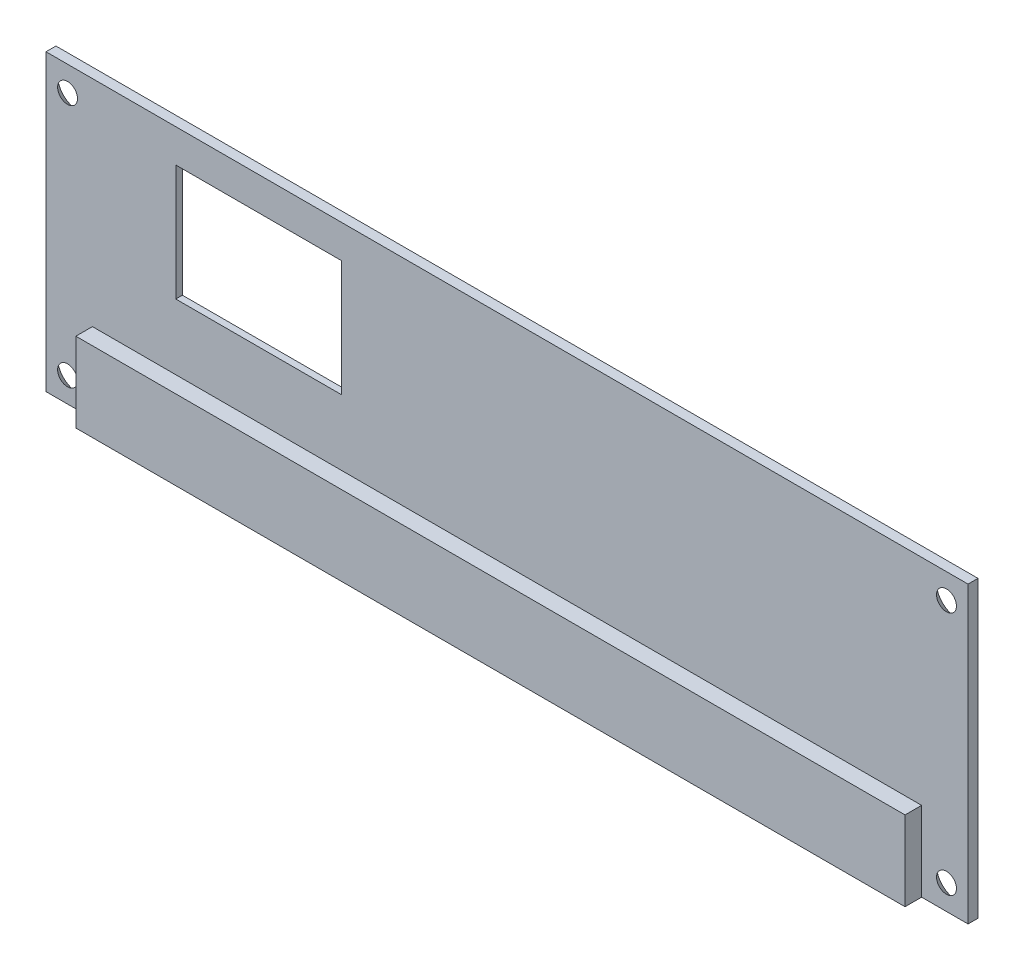
ISO-10303-21;
HEADER;
FILE_DESCRIPTION(('STEP AP214'),'2;1');
FILE_NAME('part.step','',(''),(''),'','','');
FILE_SCHEMA(('AUTOMOTIVE_DESIGN { 1 0 10303 214 1 1 1 1 }'));
ENDSEC;
DATA;
#1=APPLICATION_CONTEXT('core data for automotive mechanical design processes');
#2=APPLICATION_PROTOCOL_DEFINITION('international standard','automotive_design',2000,#1);
#3=PRODUCT_CONTEXT('',#1,'mechanical');
#4=PRODUCT('Part','Part','',(#3));
#5=PRODUCT_RELATED_PRODUCT_CATEGORY('part','',(#4));
#6=PRODUCT_DEFINITION_FORMATION('','',#4);
#7=PRODUCT_DEFINITION_CONTEXT('part definition',#1,'design');
#8=PRODUCT_DEFINITION('design','',#6,#7);
#9=PRODUCT_DEFINITION_SHAPE('','',#8);
#10=(LENGTH_UNIT() NAMED_UNIT(*) SI_UNIT(.MILLI.,.METRE.));
#11=(NAMED_UNIT(*) PLANE_ANGLE_UNIT() SI_UNIT($,.RADIAN.));
#12=(NAMED_UNIT(*) SI_UNIT($,.STERADIAN.) SOLID_ANGLE_UNIT());
#13=UNCERTAINTY_MEASURE_WITH_UNIT(LENGTH_MEASURE(1.E-05),#10,'distance_accuracy_value','');
#14=(GEOMETRIC_REPRESENTATION_CONTEXT(3) GLOBAL_UNCERTAINTY_ASSIGNED_CONTEXT((#13)) GLOBAL_UNIT_ASSIGNED_CONTEXT((#10,
#11,#12)) REPRESENTATION_CONTEXT('',''));
#15=CARTESIAN_POINT('',(0.,0.,0.));
#16=DIRECTION('',(0.,0.,1.));
#17=DIRECTION('',(1.,0.,0.));
#18=AXIS2_PLACEMENT_3D('',#15,#16,#17);
#19=CARTESIAN_POINT('',(-56.,17.75,1.2));
#20=DIRECTION('',(0.,-1.,0.));
#21=DIRECTION('',(0.,0.,-1.));
#22=AXIS2_PLACEMENT_3D('',#19,#20,#21);
#23=PLANE('',#22);
#24=DIRECTION('',(0.,0.,1.));
#25=VECTOR('',#24,1.);
#26=CARTESIAN_POINT('',(-55.6,17.75,0.));
#27=LINE('',#26,#25);
#28=CARTESIAN_POINT('',(-55.6,17.75,0.));
#29=VERTEX_POINT('',#28);
#30=CARTESIAN_POINT('',(-55.6,17.75,1.2));
#31=VERTEX_POINT('',#30);
#32=EDGE_CURVE('E194',#29,#31,#27,.T.);
#33=ORIENTED_EDGE('',*,*,#32,.T.);
#34=DIRECTION('',(-1.,0.,0.));
#35=VECTOR('',#34,1.);
#36=CARTESIAN_POINT('',(-56.,17.75,1.2));
#37=LINE('',#36,#35);
#38=CARTESIAN_POINT('',(55.6,17.75,1.2));
#39=VERTEX_POINT('',#38);
#40=EDGE_CURVE('E231',#39,#31,#37,.T.);
#41=ORIENTED_EDGE('',*,*,#40,.F.);
#42=DIRECTION('',(0.,0.,1.));
#43=VECTOR('',#42,1.);
#44=CARTESIAN_POINT('',(55.6,17.75,0.));
#45=LINE('',#44,#43);
#46=CARTESIAN_POINT('',(55.6,17.75,0.));
#47=VERTEX_POINT('',#46);
#48=EDGE_CURVE('E201',#47,#39,#45,.T.);
#49=ORIENTED_EDGE('',*,*,#48,.F.);
#50=DIRECTION('',(-1.,0.,0.));
#51=VECTOR('',#50,1.);
#52=CARTESIAN_POINT('',(-56.,17.75,0.));
#53=LINE('',#52,#51);
#54=EDGE_CURVE('E230',#47,#29,#53,.T.);
#55=ORIENTED_EDGE('',*,*,#54,.T.);
#56=EDGE_LOOP('',(#33,#41,#49,#55));
#57=FACE_BOUND('',#56,.T.);
#58=ADVANCED_FACE('F37',(#57),#23,.F.);
#59=CARTESIAN_POINT('',(-56.,-17.75,1.2));
#60=DIRECTION('',(0.,1.,0.));
#61=DIRECTION('',(0.,0.,1.));
#62=AXIS2_PLACEMENT_3D('',#59,#60,#61);
#63=PLANE('',#62);
#64=DIRECTION('',(0.,0.,-1.));
#65=VECTOR('',#64,1.);
#66=CARTESIAN_POINT('',(-50.,-17.75,39.1389760566436));
#67=LINE('',#66,#65);
#68=CARTESIAN_POINT('',(-50.,-17.75,3.2));
#69=VERTEX_POINT('',#68);
#70=CARTESIAN_POINT('',(-50.,-17.75,1.2));
#71=VERTEX_POINT('',#70);
#72=EDGE_CURVE('E156',#69,#71,#67,.T.);
#73=ORIENTED_EDGE('',*,*,#72,.T.);
#74=DIRECTION('',(1.,0.,0.));
#75=VECTOR('',#74,1.);
#76=CARTESIAN_POINT('',(-50.,-17.75,1.2));
#77=LINE('',#76,#75);
#78=CARTESIAN_POINT('',(-55.6,-17.75,1.2));
#79=VERTEX_POINT('',#78);
#80=EDGE_CURVE('E141',#79,#71,#77,.T.);
#81=ORIENTED_EDGE('',*,*,#80,.F.);
#82=DIRECTION('',(0.,0.,1.));
#83=VECTOR('',#82,1.);
#84=CARTESIAN_POINT('',(-55.6,-17.75,0.));
#85=LINE('',#84,#83);
#86=CARTESIAN_POINT('',(-55.6,-17.75,0.));
#87=VERTEX_POINT('',#86);
#88=EDGE_CURVE('E192',#87,#79,#85,.T.);
#89=ORIENTED_EDGE('',*,*,#88,.F.);
#90=DIRECTION('',(1.,0.,0.));
#91=VECTOR('',#90,1.);
#92=CARTESIAN_POINT('',(-56.,-17.75,0.));
#93=LINE('',#92,#91);
#94=CARTESIAN_POINT('',(55.6,-17.75,0.));
#95=VERTEX_POINT('',#94);
#96=EDGE_CURVE('E234',#87,#95,#93,.T.);
#97=ORIENTED_EDGE('',*,*,#96,.T.);
#98=DIRECTION('',(0.,0.,1.));
#99=VECTOR('',#98,1.);
#100=CARTESIAN_POINT('',(55.6,-17.75,0.));
#101=LINE('',#100,#99);
#102=CARTESIAN_POINT('',(55.6,-17.75,1.2));
#103=VERTEX_POINT('',#102);
#104=EDGE_CURVE('E193',#95,#103,#101,.T.);
#105=ORIENTED_EDGE('',*,*,#104,.T.);
#106=DIRECTION('',(1.,0.,0.));
#107=VECTOR('',#106,1.);
#108=CARTESIAN_POINT('',(50.,-17.75,1.2));
#109=LINE('',#108,#107);
#110=CARTESIAN_POINT('',(50.,-17.75,1.2));
#111=VERTEX_POINT('',#110);
#112=EDGE_CURVE('E174',#111,#103,#109,.T.);
#113=ORIENTED_EDGE('',*,*,#112,.F.);
#114=DIRECTION('',(0.,0.,-1.));
#115=VECTOR('',#114,1.);
#116=CARTESIAN_POINT('',(50.,-17.75,39.1389760566436));
#117=LINE('',#116,#115);
#118=CARTESIAN_POINT('',(50.,-17.75,3.2));
#119=VERTEX_POINT('',#118);
#120=EDGE_CURVE('E176',#119,#111,#117,.T.);
#121=ORIENTED_EDGE('',*,*,#120,.F.);
#122=DIRECTION('',(1.,0.,0.));
#123=VECTOR('',#122,1.);
#124=CARTESIAN_POINT('',(56.,-17.75,3.2));
#125=LINE('',#124,#123);
#126=EDGE_CURVE('E165',#69,#119,#125,.T.);
#127=ORIENTED_EDGE('',*,*,#126,.F.);
#128=EDGE_LOOP('',(#73,#81,#89,#97,#105,#113,#121,#127));
#129=FACE_BOUND('',#128,.T.);
#130=ADVANCED_FACE('F162',(#129),#63,.F.);
#131=CARTESIAN_POINT('',(0.,0.,3.2));
#132=DIRECTION('',(0.,0.,1.));
#133=DIRECTION('',(1.,0.,0.));
#134=AXIS2_PLACEMENT_3D('',#131,#132,#133);
#135=PLANE('',#134);
#136=DIRECTION('',(1.,0.,0.));
#137=VECTOR('',#136,1.);
#138=CARTESIAN_POINT('',(0.,-8.15681044697117,3.19999999999999));
#139=LINE('',#138,#137);
#140=CARTESIAN_POINT('',(-50.,-8.15681044697117,3.19999999999999));
#141=VERTEX_POINT('',#140);
#142=CARTESIAN_POINT('',(50.,-8.15681044697117,3.2));
#143=VERTEX_POINT('',#142);
#144=EDGE_CURVE('E182',#141,#143,#139,.T.);
#145=ORIENTED_EDGE('',*,*,#144,.F.);
#146=DIRECTION('',(0.,1.,0.));
#147=VECTOR('',#146,1.);
#148=CARTESIAN_POINT('',(-50.,17.75,3.2));
#149=LINE('',#148,#147);
#150=EDGE_CURVE('E152',#69,#141,#149,.T.);
#151=ORIENTED_EDGE('',*,*,#150,.F.);
#152=ORIENTED_EDGE('',*,*,#126,.T.);
#153=DIRECTION('',(0.,-1.,0.));
#154=VECTOR('',#153,1.);
#155=CARTESIAN_POINT('',(50.,17.75,3.2));
#156=LINE('',#155,#154);
#157=EDGE_CURVE('E166',#143,#119,#156,.T.);
#158=ORIENTED_EDGE('',*,*,#157,.F.);
#159=EDGE_LOOP('',(#145,#151,#152,#158));
#160=FACE_BOUND('',#159,.T.);
#161=ADVANCED_FACE('F350',(#160),#135,.T.);
#162=CARTESIAN_POINT('',(55.6,17.75,0.));
#163=DIRECTION('',(-1.,0.,0.));
#164=DIRECTION('',(0.,-1.,0.));
#165=AXIS2_PLACEMENT_3D('',#162,#163,#164);
#166=PLANE('',#165);
#167=DIRECTION('',(0.,1.,0.));
#168=VECTOR('',#167,1.);
#169=CARTESIAN_POINT('',(55.6,17.75,1.2));
#170=LINE('',#169,#168);
#171=EDGE_CURVE('E168',#103,#39,#170,.T.);
#172=ORIENTED_EDGE('',*,*,#171,.F.);
#173=ORIENTED_EDGE('',*,*,#104,.F.);
#174=DIRECTION('',(0.,-1.,0.));
#175=VECTOR('',#174,1.);
#176=CARTESIAN_POINT('',(55.6,17.75,0.));
#177=LINE('',#176,#175);
#178=EDGE_CURVE('E181',#47,#95,#177,.T.);
#179=ORIENTED_EDGE('',*,*,#178,.F.);
#180=ORIENTED_EDGE('',*,*,#48,.T.);
#181=EDGE_LOOP('',(#172,#173,#179,#180));
#182=FACE_BOUND('',#181,.T.);
#183=ADVANCED_FACE('F450',(#182),#166,.F.);
#184=CARTESIAN_POINT('',(0.,0.,1.2));
#185=DIRECTION('',(0.,0.,-1.));
#186=DIRECTION('',(-1.,0.,0.));
#187=AXIS2_PLACEMENT_3D('',#184,#185,#186);
#188=PLANE('',#187);
#189=CARTESIAN_POINT('',(-53.,14.75,1.2));
#190=DIRECTION('',(0.,0.,-1.));
#191=DIRECTION('',(-1.,0.,0.));
#192=AXIS2_PLACEMENT_3D('',#189,#190,#191);
#193=CIRCLE('',#192,1.20000000000002);
#194=CARTESIAN_POINT('',(-54.2,14.75,1.2));
#195=VERTEX_POINT('',#194);
#196=EDGE_CURVE('E11',#195,#195,#193,.T.);
#197=ORIENTED_EDGE('',*,*,#196,.T.);
#198=EDGE_LOOP('',(#197));
#199=FACE_BOUND('',#198,.T.);
#200=CARTESIAN_POINT('',(-53.,-14.75,1.2));
#201=DIRECTION('',(0.,0.,-1.));
#202=DIRECTION('',(-1.,0.,0.));
#203=AXIS2_PLACEMENT_3D('',#200,#201,#202);
#204=CIRCLE('',#203,1.20000000000002);
#205=CARTESIAN_POINT('',(-54.2,-14.75,1.2));
#206=VERTEX_POINT('',#205);
#207=EDGE_CURVE('E46',#206,#206,#204,.T.);
#208=ORIENTED_EDGE('',*,*,#207,.T.);
#209=EDGE_LOOP('',(#208));
#210=FACE_BOUND('',#209,.T.);
#211=CARTESIAN_POINT('',(53.,-14.7500000000001,1.2));
#212=DIRECTION('',(0.,0.,-1.));
#213=DIRECTION('',(-1.,0.,0.));
#214=AXIS2_PLACEMENT_3D('',#211,#212,#213);
#215=CIRCLE('',#214,1.20000000000002);
#216=CARTESIAN_POINT('',(51.8,-14.7500000000001,1.2));
#217=VERTEX_POINT('',#216);
#218=EDGE_CURVE('E278',#217,#217,#215,.T.);
#219=ORIENTED_EDGE('',*,*,#218,.T.);
#220=EDGE_LOOP('',(#219));
#221=FACE_BOUND('',#220,.T.);
#222=CARTESIAN_POINT('',(53.,14.7499999999999,1.2));
#223=DIRECTION('',(0.,0.,-1.));
#224=DIRECTION('',(-1.,0.,0.));
#225=AXIS2_PLACEMENT_3D('',#222,#223,#224);
#226=CIRCLE('',#225,1.20000000000002);
#227=CARTESIAN_POINT('',(51.8,14.7499999999999,1.2));
#228=VERTEX_POINT('',#227);
#229=EDGE_CURVE('E275',#228,#228,#226,.T.);
#230=ORIENTED_EDGE('',*,*,#229,.T.);
#231=EDGE_LOOP('',(#230));
#232=FACE_BOUND('',#231,.T.);
#233=DIRECTION('',(-1.,0.,0.));
#234=VECTOR('',#233,1.);
#235=CARTESIAN_POINT('',(0.,-0.249999999999995,1.2));
#236=LINE('',#235,#234);
#237=CARTESIAN_POINT('',(-19.95,-0.249999999999995,1.2));
#238=VERTEX_POINT('',#237);
#239=CARTESIAN_POINT('',(-39.95,-0.249999999999995,1.2));
#240=VERTEX_POINT('',#239);
#241=EDGE_CURVE('E223',#238,#240,#236,.T.);
#242=ORIENTED_EDGE('',*,*,#241,.T.);
#243=DIRECTION('',(0.,1.,0.));
#244=VECTOR('',#243,1.);
#245=CARTESIAN_POINT('',(-39.95,0.,1.2));
#246=LINE('',#245,#244);
#247=CARTESIAN_POINT('',(-39.95,13.75,1.2));
#248=VERTEX_POINT('',#247);
#249=EDGE_CURVE('E226',#240,#248,#246,.T.);
#250=ORIENTED_EDGE('',*,*,#249,.T.);
#251=DIRECTION('',(1.,0.,0.));
#252=VECTOR('',#251,1.);
#253=CARTESIAN_POINT('',(0.,13.75,1.2));
#254=LINE('',#253,#252);
#255=CARTESIAN_POINT('',(-19.95,13.75,1.2));
#256=VERTEX_POINT('',#255);
#257=EDGE_CURVE('E208',#248,#256,#254,.T.);
#258=ORIENTED_EDGE('',*,*,#257,.T.);
#259=DIRECTION('',(0.,-1.,0.));
#260=VECTOR('',#259,1.);
#261=CARTESIAN_POINT('',(-19.95,0.,1.2));
#262=LINE('',#261,#260);
#263=EDGE_CURVE('E220',#256,#238,#262,.T.);
#264=ORIENTED_EDGE('',*,*,#263,.T.);
#265=EDGE_LOOP('',(#242,#250,#258,#264));
#266=FACE_BOUND('',#265,.T.);
#267=ORIENTED_EDGE('',*,*,#40,.T.);
#268=DIRECTION('',(0.,-1.,0.));
#269=VECTOR('',#268,1.);
#270=CARTESIAN_POINT('',(-55.6,17.75,1.2));
#271=LINE('',#270,#269);
#272=EDGE_CURVE('E147',#31,#79,#271,.T.);
#273=ORIENTED_EDGE('',*,*,#272,.T.);
#274=ORIENTED_EDGE('',*,*,#80,.T.);
#275=DIRECTION('',(0.,1.,0.));
#276=VECTOR('',#275,1.);
#277=CARTESIAN_POINT('',(-50.,17.75,1.2));
#278=LINE('',#277,#276);
#279=CARTESIAN_POINT('',(-50.,-8.15681044697117,1.2));
#280=VERTEX_POINT('',#279);
#281=EDGE_CURVE('E144',#71,#280,#278,.T.);
#282=ORIENTED_EDGE('',*,*,#281,.T.);
#283=DIRECTION('',(1.,0.,0.));
#284=VECTOR('',#283,1.);
#285=CARTESIAN_POINT('',(0.,-8.15681044697117,1.2));
#286=LINE('',#285,#284);
#287=CARTESIAN_POINT('',(50.,-8.15681044697117,1.2));
#288=VERTEX_POINT('',#287);
#289=EDGE_CURVE('E179',#280,#288,#286,.T.);
#290=ORIENTED_EDGE('',*,*,#289,.T.);
#291=DIRECTION('',(0.,-1.,0.));
#292=VECTOR('',#291,1.);
#293=CARTESIAN_POINT('',(50.,17.75,1.2));
#294=LINE('',#293,#292);
#295=EDGE_CURVE('E53',#288,#111,#294,.T.);
#296=ORIENTED_EDGE('',*,*,#295,.T.);
#297=ORIENTED_EDGE('',*,*,#112,.T.);
#298=ORIENTED_EDGE('',*,*,#171,.T.);
#299=EDGE_LOOP('',(#267,#273,#274,#282,#290,#296,#297,#298));
#300=FACE_BOUND('',#299,.T.);
#301=ADVANCED_FACE('F143',(#199,#210,#221,#232,#266,#300),#188,.F.);
#302=CARTESIAN_POINT('',(0.,0.,0.));
#303=DIRECTION('',(0.,0.,-1.));
#304=DIRECTION('',(-1.,0.,0.));
#305=AXIS2_PLACEMENT_3D('',#302,#303,#304);
#306=PLANE('',#305);
#307=CARTESIAN_POINT('',(-53.,14.75,0.));
#308=DIRECTION('',(0.,0.,-1.));
#309=DIRECTION('',(-1.,0.,0.));
#310=AXIS2_PLACEMENT_3D('',#307,#308,#309);
#311=CIRCLE('',#310,2.40000000000003);
#312=CARTESIAN_POINT('',(-55.4,14.75,0.));
#313=VERTEX_POINT('',#312);
#314=EDGE_CURVE('E272',#313,#313,#311,.F.);
#315=ORIENTED_EDGE('',*,*,#314,.T.);
#316=EDGE_LOOP('',(#315));
#317=FACE_BOUND('',#316,.T.);
#318=CARTESIAN_POINT('',(-53.,-14.75,0.));
#319=DIRECTION('',(0.,0.,-1.));
#320=DIRECTION('',(-1.,0.,0.));
#321=AXIS2_PLACEMENT_3D('',#318,#319,#320);
#322=CIRCLE('',#321,2.40000000000003);
#323=CARTESIAN_POINT('',(-55.4,-14.75,0.));
#324=VERTEX_POINT('',#323);
#325=EDGE_CURVE('E269',#324,#324,#322,.F.);
#326=ORIENTED_EDGE('',*,*,#325,.T.);
#327=EDGE_LOOP('',(#326));
#328=FACE_BOUND('',#327,.T.);
#329=CARTESIAN_POINT('',(53.,-14.7500000000001,0.));
#330=DIRECTION('',(0.,0.,-1.));
#331=DIRECTION('',(-1.,0.,0.));
#332=AXIS2_PLACEMENT_3D('',#329,#330,#331);
#333=CIRCLE('',#332,2.40000000000003);
#334=CARTESIAN_POINT('',(50.6,-14.7500000000001,0.));
#335=VERTEX_POINT('',#334);
#336=EDGE_CURVE('E266',#335,#335,#333,.F.);
#337=ORIENTED_EDGE('',*,*,#336,.T.);
#338=EDGE_LOOP('',(#337));
#339=FACE_BOUND('',#338,.T.);
#340=CARTESIAN_POINT('',(53.,14.7499999999999,0.));
#341=DIRECTION('',(0.,0.,-1.));
#342=DIRECTION('',(-1.,0.,0.));
#343=AXIS2_PLACEMENT_3D('',#340,#341,#342);
#344=CIRCLE('',#343,2.40000000000003);
#345=CARTESIAN_POINT('',(50.6,14.7499999999999,0.));
#346=VERTEX_POINT('',#345);
#347=EDGE_CURVE('E255',#346,#346,#344,.F.);
#348=ORIENTED_EDGE('',*,*,#347,.T.);
#349=EDGE_LOOP('',(#348));
#350=FACE_BOUND('',#349,.T.);
#351=DIRECTION('',(0.,1.,0.));
#352=VECTOR('',#351,1.);
#353=CARTESIAN_POINT('',(-55.6,17.75,0.));
#354=LINE('',#353,#352);
#355=EDGE_CURVE('E189',#87,#29,#354,.T.);
#356=ORIENTED_EDGE('',*,*,#355,.T.);
#357=ORIENTED_EDGE('',*,*,#54,.F.);
#358=ORIENTED_EDGE('',*,*,#178,.T.);
#359=ORIENTED_EDGE('',*,*,#96,.F.);
#360=EDGE_LOOP('',(#356,#357,#358,#359));
#361=FACE_BOUND('',#360,.T.);
#362=DIRECTION('',(0.,1.,0.));
#363=VECTOR('',#362,1.);
#364=CARTESIAN_POINT('',(-19.55,13.75,0.));
#365=LINE('',#364,#363);
#366=CARTESIAN_POINT('',(-19.55,-0.649999999999992,0.));
#367=VERTEX_POINT('',#366);
#368=CARTESIAN_POINT('',(-19.55,14.15,0.));
#369=VERTEX_POINT('',#368);
#370=EDGE_CURVE('E245',#367,#369,#365,.T.);
#371=ORIENTED_EDGE('',*,*,#370,.T.);
#372=DIRECTION('',(-1.,0.,0.));
#373=VECTOR('',#372,1.);
#374=CARTESIAN_POINT('',(-39.95,14.15,0.));
#375=LINE('',#374,#373);
#376=CARTESIAN_POINT('',(-40.35,14.15,0.));
#377=VERTEX_POINT('',#376);
#378=EDGE_CURVE('E247',#369,#377,#375,.T.);
#379=ORIENTED_EDGE('',*,*,#378,.T.);
#380=DIRECTION('',(0.,-1.,0.));
#381=VECTOR('',#380,1.);
#382=CARTESIAN_POINT('',(-40.35,-0.249999999999995,0.));
#383=LINE('',#382,#381);
#384=CARTESIAN_POINT('',(-40.35,-0.649999999999992,0.));
#385=VERTEX_POINT('',#384);
#386=EDGE_CURVE('E241',#377,#385,#383,.T.);
#387=ORIENTED_EDGE('',*,*,#386,.T.);
#388=DIRECTION('',(1.,0.,0.));
#389=VECTOR('',#388,1.);
#390=CARTESIAN_POINT('',(-19.95,-0.649999999999992,0.));
#391=LINE('',#390,#389);
#392=EDGE_CURVE('E243',#385,#367,#391,.T.);
#393=ORIENTED_EDGE('',*,*,#392,.T.);
#394=EDGE_LOOP('',(#371,#379,#387,#393));
#395=FACE_BOUND('',#394,.T.);
#396=ADVANCED_FACE('F293',(#317,#328,#339,#350,#361,#395),#306,.T.);
#397=CARTESIAN_POINT('',(-39.95,-0.249999999999995,3.2));
#398=DIRECTION('',(-1.,0.,0.));
#399=DIRECTION('',(0.,0.,1.));
#400=AXIS2_PLACEMENT_3D('',#397,#398,#399);
#401=PLANE('',#400);
#402=DIRECTION('',(0.,0.,-1.));
#403=VECTOR('',#402,1.);
#404=CARTESIAN_POINT('',(-39.95,-0.249999999999995,3.2));
#405=LINE('',#404,#403);
#406=CARTESIAN_POINT('',(-39.95,-0.249999999999995,0.399999999999998));
#407=VERTEX_POINT('',#406);
#408=EDGE_CURVE('E206',#240,#407,#405,.T.);
#409=ORIENTED_EDGE('',*,*,#408,.T.);
#410=DIRECTION('',(0.,1.,0.));
#411=VECTOR('',#410,1.);
#412=CARTESIAN_POINT('',(-39.95,13.75,0.399999999999998));
#413=LINE('',#412,#411);
#414=CARTESIAN_POINT('',(-39.95,13.75,0.399999999999998));
#415=VERTEX_POINT('',#414);
#416=EDGE_CURVE('E253',#407,#415,#413,.T.);
#417=ORIENTED_EDGE('',*,*,#416,.T.);
#418=DIRECTION('',(0.,0.,-1.));
#419=VECTOR('',#418,1.);
#420=CARTESIAN_POINT('',(-39.95,13.75,3.2));
#421=LINE('',#420,#419);
#422=EDGE_CURVE('E214',#248,#415,#421,.T.);
#423=ORIENTED_EDGE('',*,*,#422,.F.);
#424=ORIENTED_EDGE('',*,*,#249,.F.);
#425=EDGE_LOOP('',(#409,#417,#423,#424));
#426=FACE_BOUND('',#425,.T.);
#427=ADVANCED_FACE('F296',(#426),#401,.F.);
#428=CARTESIAN_POINT('',(-19.95,-0.249999999999995,3.2));
#429=DIRECTION('',(0.,-1.,0.));
#430=DIRECTION('',(0.,0.,-1.));
#431=AXIS2_PLACEMENT_3D('',#428,#429,#430);
#432=PLANE('',#431);
#433=DIRECTION('',(0.,0.,-1.));
#434=VECTOR('',#433,1.);
#435=CARTESIAN_POINT('',(-19.95,-0.249999999999995,3.2));
#436=LINE('',#435,#434);
#437=CARTESIAN_POINT('',(-19.95,-0.249999999999995,0.399999999999998));
#438=VERTEX_POINT('',#437);
#439=EDGE_CURVE('E209',#238,#438,#436,.T.);
#440=ORIENTED_EDGE('',*,*,#439,.T.);
#441=DIRECTION('',(-1.,0.,0.));
#442=VECTOR('',#441,1.);
#443=CARTESIAN_POINT('',(-39.95,-0.249999999999995,0.399999999999998));
#444=LINE('',#443,#442);
#445=EDGE_CURVE('E61',#438,#407,#444,.T.);
#446=ORIENTED_EDGE('',*,*,#445,.T.);
#447=ORIENTED_EDGE('',*,*,#408,.F.);
#448=ORIENTED_EDGE('',*,*,#241,.F.);
#449=EDGE_LOOP('',(#440,#446,#447,#448));
#450=FACE_BOUND('',#449,.T.);
#451=ADVANCED_FACE('F500',(#450),#432,.F.);
#452=CARTESIAN_POINT('',(-19.95,-0.249999999999995,3.2));
#453=DIRECTION('',(1.,0.,0.));
#454=DIRECTION('',(0.,0.,-1.));
#455=AXIS2_PLACEMENT_3D('',#452,#453,#454);
#456=PLANE('',#455);
#457=DIRECTION('',(0.,0.,-1.));
#458=VECTOR('',#457,1.);
#459=CARTESIAN_POINT('',(-19.95,13.75,3.2));
#460=LINE('',#459,#458);
#461=CARTESIAN_POINT('',(-19.95,13.75,0.399999999999998));
#462=VERTEX_POINT('',#461);
#463=EDGE_CURVE('E211',#256,#462,#460,.T.);
#464=ORIENTED_EDGE('',*,*,#463,.T.);
#465=DIRECTION('',(0.,-1.,0.));
#466=VECTOR('',#465,1.);
#467=CARTESIAN_POINT('',(-19.95,-0.249999999999995,0.399999999999998));
#468=LINE('',#467,#466);
#469=EDGE_CURVE('E250',#462,#438,#468,.T.);
#470=ORIENTED_EDGE('',*,*,#469,.T.);
#471=ORIENTED_EDGE('',*,*,#439,.F.);
#472=ORIENTED_EDGE('',*,*,#263,.F.);
#473=EDGE_LOOP('',(#464,#470,#471,#472));
#474=FACE_BOUND('',#473,.T.);
#475=ADVANCED_FACE('F325',(#474),#456,.F.);
#476=CARTESIAN_POINT('',(-19.95,13.75,3.2));
#477=DIRECTION('',(0.,1.,0.));
#478=DIRECTION('',(0.,0.,1.));
#479=AXIS2_PLACEMENT_3D('',#476,#477,#478);
#480=PLANE('',#479);
#481=ORIENTED_EDGE('',*,*,#422,.T.);
#482=DIRECTION('',(1.,0.,0.));
#483=VECTOR('',#482,1.);
#484=CARTESIAN_POINT('',(-19.95,13.75,0.399999999999998));
#485=LINE('',#484,#483);
#486=EDGE_CURVE('E233',#415,#462,#485,.T.);
#487=ORIENTED_EDGE('',*,*,#486,.T.);
#488=ORIENTED_EDGE('',*,*,#463,.F.);
#489=ORIENTED_EDGE('',*,*,#257,.F.);
#490=EDGE_LOOP('',(#481,#487,#488,#489));
#491=FACE_BOUND('',#490,.T.);
#492=ADVANCED_FACE('F322',(#491),#480,.F.);
#493=CARTESIAN_POINT('',(-19.95,-0.249999999999995,0.399999999999998));
#494=DIRECTION('',(0.,0.707106781186548,-0.707106781186547));
#495=DIRECTION('',(1.,0.,0.));
#496=AXIS2_PLACEMENT_3D('',#493,#494,#495);
#497=PLANE('',#496);
#498=DIRECTION('',(0.577350269189626,-0.577350269189626,-0.577350269189626));
#499=VECTOR('',#498,1.);
#500=CARTESIAN_POINT('',(-19.95,-0.249999999999995,0.399999999999998));
#501=LINE('',#500,#499);
#502=EDGE_CURVE('E259',#367,#438,#501,.F.);
#503=ORIENTED_EDGE('',*,*,#502,.F.);
#504=ORIENTED_EDGE('',*,*,#392,.F.);
#505=DIRECTION('',(-0.577350269189626,-0.577350269189626,-0.577350269189626));
#506=VECTOR('',#505,1.);
#507=CARTESIAN_POINT('',(-33.2833333333333,6.41666666666667,7.06666666666667));
#508=LINE('',#507,#506);
#509=EDGE_CURVE('E217',#407,#385,#508,.T.);
#510=ORIENTED_EDGE('',*,*,#509,.F.);
#511=ORIENTED_EDGE('',*,*,#445,.F.);
#512=EDGE_LOOP('',(#503,#504,#510,#511));
#513=FACE_BOUND('',#512,.T.);
#514=ADVANCED_FACE('F333',(#513),#497,.T.);
#515=CARTESIAN_POINT('',(-39.95,-0.249999999999995,0.399999999999998));
#516=DIRECTION('',(0.707106781186548,0.,-0.707106781186548));
#517=DIRECTION('',(0.,-1.,0.));
#518=AXIS2_PLACEMENT_3D('',#515,#516,#517);
#519=PLANE('',#518);
#520=ORIENTED_EDGE('',*,*,#509,.T.);
#521=ORIENTED_EDGE('',*,*,#386,.F.);
#522=DIRECTION('',(0.577350269189626,-0.577350269189626,0.577350269189626));
#523=VECTOR('',#522,1.);
#524=CARTESIAN_POINT('',(-33.2833333333333,7.08333333333334,7.06666666666666));
#525=LINE('',#524,#523);
#526=EDGE_CURVE('E257',#415,#377,#525,.F.);
#527=ORIENTED_EDGE('',*,*,#526,.F.);
#528=ORIENTED_EDGE('',*,*,#416,.F.);
#529=EDGE_LOOP('',(#520,#521,#527,#528));
#530=FACE_BOUND('',#529,.T.);
#531=ADVANCED_FACE('F331',(#530),#519,.T.);
#532=CARTESIAN_POINT('',(-19.95,-0.249999999999995,0.399999999999998));
#533=DIRECTION('',(-0.707106781186548,0.,-0.707106781186548));
#534=DIRECTION('',(0.,1.,0.));
#535=AXIS2_PLACEMENT_3D('',#532,#533,#534);
#536=PLANE('',#535);
#537=ORIENTED_EDGE('',*,*,#502,.T.);
#538=ORIENTED_EDGE('',*,*,#469,.F.);
#539=DIRECTION('',(0.577350269189626,0.577350269189626,-0.577350269189626));
#540=VECTOR('',#539,1.);
#541=CARTESIAN_POINT('',(-19.95,13.75,0.399999999999998));
#542=LINE('',#541,#540);
#543=EDGE_CURVE('E197',#369,#462,#542,.F.);
#544=ORIENTED_EDGE('',*,*,#543,.F.);
#545=ORIENTED_EDGE('',*,*,#370,.F.);
#546=EDGE_LOOP('',(#537,#538,#544,#545));
#547=FACE_BOUND('',#546,.T.);
#548=ADVANCED_FACE('F318',(#547),#536,.T.);
#549=CARTESIAN_POINT('',(-19.95,13.75,0.399999999999998));
#550=DIRECTION('',(0.,-0.707106781186548,-0.707106781186548));
#551=DIRECTION('',(-1.,0.,0.));
#552=AXIS2_PLACEMENT_3D('',#549,#550,#551);
#553=PLANE('',#552);
#554=ORIENTED_EDGE('',*,*,#526,.T.);
#555=ORIENTED_EDGE('',*,*,#378,.F.);
#556=ORIENTED_EDGE('',*,*,#543,.T.);
#557=ORIENTED_EDGE('',*,*,#486,.F.);
#558=EDGE_LOOP('',(#554,#555,#556,#557));
#559=FACE_BOUND('',#558,.T.);
#560=ADVANCED_FACE('F313',(#559),#553,.T.);
#561=CARTESIAN_POINT('',(-55.6,17.75,0.));
#562=DIRECTION('',(1.,0.,0.));
#563=DIRECTION('',(0.,1.,0.));
#564=AXIS2_PLACEMENT_3D('',#561,#562,#563);
#565=PLANE('',#564);
#566=ORIENTED_EDGE('',*,*,#88,.T.);
#567=ORIENTED_EDGE('',*,*,#272,.F.);
#568=ORIENTED_EDGE('',*,*,#32,.F.);
#569=ORIENTED_EDGE('',*,*,#355,.F.);
#570=EDGE_LOOP('',(#566,#567,#568,#569));
#571=FACE_BOUND('',#570,.T.);
#572=ADVANCED_FACE('F360',(#571),#565,.F.);
#573=CARTESIAN_POINT('',(0.,-8.15681044697117,118.246468872365));
#574=DIRECTION('',(0.,1.,0.));
#575=DIRECTION('',(0.,0.,1.));
#576=AXIS2_PLACEMENT_3D('',#573,#574,#575);
#577=PLANE('',#576);
#578=DIRECTION('',(0.,0.,-1.));
#579=VECTOR('',#578,1.);
#580=CARTESIAN_POINT('',(-50.,-8.15681044697117,118.246468872365));
#581=LINE('',#580,#579);
#582=EDGE_CURVE('E159',#141,#280,#581,.T.);
#583=ORIENTED_EDGE('',*,*,#582,.F.);
#584=ORIENTED_EDGE('',*,*,#144,.T.);
#585=DIRECTION('',(0.,0.,-1.));
#586=VECTOR('',#585,1.);
#587=CARTESIAN_POINT('',(50.,-8.15681044697117,118.246468872365));
#588=LINE('',#587,#586);
#589=EDGE_CURVE('E185',#143,#288,#588,.T.);
#590=ORIENTED_EDGE('',*,*,#589,.T.);
#591=ORIENTED_EDGE('',*,*,#289,.F.);
#592=EDGE_LOOP('',(#583,#584,#590,#591));
#593=FACE_BOUND('',#592,.T.);
#594=ADVANCED_FACE('F383',(#593),#577,.T.);
#595=CARTESIAN_POINT('',(50.,17.75,39.1389760566436));
#596=DIRECTION('',(1.,0.,0.));
#597=DIRECTION('',(0.,0.,-1.));
#598=AXIS2_PLACEMENT_3D('',#595,#596,#597);
#599=PLANE('',#598);
#600=ORIENTED_EDGE('',*,*,#157,.T.);
#601=ORIENTED_EDGE('',*,*,#120,.T.);
#602=ORIENTED_EDGE('',*,*,#295,.F.);
#603=ORIENTED_EDGE('',*,*,#589,.F.);
#604=EDGE_LOOP('',(#600,#601,#602,#603));
#605=FACE_BOUND('',#604,.T.);
#606=ADVANCED_FACE('F392',(#605),#599,.T.);
#607=CARTESIAN_POINT('',(-50.,17.75,39.1389760566436));
#608=DIRECTION('',(-1.,0.,0.));
#609=DIRECTION('',(0.,0.,1.));
#610=AXIS2_PLACEMENT_3D('',#607,#608,#609);
#611=PLANE('',#610);
#612=ORIENTED_EDGE('',*,*,#281,.F.);
#613=ORIENTED_EDGE('',*,*,#72,.F.);
#614=ORIENTED_EDGE('',*,*,#150,.T.);
#615=ORIENTED_EDGE('',*,*,#582,.T.);
#616=EDGE_LOOP('',(#612,#613,#614,#615));
#617=FACE_BOUND('',#616,.T.);
#618=ADVANCED_FACE('F155',(#617),#611,.T.);
#619=CARTESIAN_POINT('',(-53.,14.75,0.));
#620=DIRECTION('',(0.,0.,-1.));
#621=DIRECTION('',(-1.,0.,0.));
#622=AXIS2_PLACEMENT_3D('',#619,#620,#621);
#623=CONICAL_SURFACE('',#622,2.40000000000003,0.785398163397453);
#624=CARTESIAN_POINT('',(-54.2,14.75,1.2));
#625=CARTESIAN_POINT('',(-54.2125,14.75,1.1875));
#626=CARTESIAN_POINT('',(-54.225,14.75,1.175));
#627=CARTESIAN_POINT('',(-54.25,14.75,1.15));
#628=CARTESIAN_POINT('',(-54.2625,14.75,1.1375));
#629=CARTESIAN_POINT('',(-54.2875,14.75,1.1125));
#630=CARTESIAN_POINT('',(-54.3,14.75,1.1));
#631=CARTESIAN_POINT('',(-54.325,14.75,1.075));
#632=CARTESIAN_POINT('',(-54.3375,14.75,1.0625));
#633=CARTESIAN_POINT('',(-54.3625,14.75,1.0375));
#634=CARTESIAN_POINT('',(-54.375,14.75,1.025));
#635=CARTESIAN_POINT('',(-54.4,14.75,1.));
#636=CARTESIAN_POINT('',(-54.4125,14.75,0.9875));
#637=CARTESIAN_POINT('',(-54.4375,14.75,0.962499999999999));
#638=CARTESIAN_POINT('',(-54.45,14.75,0.95));
#639=CARTESIAN_POINT('',(-54.475,14.75,0.925));
#640=CARTESIAN_POINT('',(-54.4875,14.75,0.912500000000001));
#641=CARTESIAN_POINT('',(-54.5125,14.75,0.8875));
#642=CARTESIAN_POINT('',(-54.525,14.75,0.874999999999999));
#643=CARTESIAN_POINT('',(-54.55,14.75,0.849999999999999));
#644=CARTESIAN_POINT('',(-54.5625,14.75,0.837500000000001));
#645=CARTESIAN_POINT('',(-54.5875,14.75,0.812500000000001));
#646=CARTESIAN_POINT('',(-54.6,14.75,0.8));
#647=CARTESIAN_POINT('',(-54.625,14.75,0.774999999999999));
#648=CARTESIAN_POINT('',(-54.6375,14.75,0.7625));
#649=CARTESIAN_POINT('',(-54.6625,14.75,0.7375));
#650=CARTESIAN_POINT('',(-54.675,14.75,0.725000000000001));
#651=CARTESIAN_POINT('',(-54.7,14.75,0.7));
#652=CARTESIAN_POINT('',(-54.7125,14.75,0.6875));
#653=CARTESIAN_POINT('',(-54.7375,14.75,0.662499999999999));
#654=CARTESIAN_POINT('',(-54.75,14.75,0.65));
#655=CARTESIAN_POINT('',(-54.775,14.75,0.625));
#656=CARTESIAN_POINT('',(-54.7875,14.75,0.612500000000001));
#657=CARTESIAN_POINT('',(-54.8125,14.75,0.5875));
#658=CARTESIAN_POINT('',(-54.825,14.75,0.575));
#659=CARTESIAN_POINT('',(-54.85,14.75,0.549999999999999));
#660=CARTESIAN_POINT('',(-54.8625,14.75,0.5375));
#661=CARTESIAN_POINT('',(-54.8875,14.75,0.5125));
#662=CARTESIAN_POINT('',(-54.9,14.75,0.500000000000001));
#663=CARTESIAN_POINT('',(-54.925,14.75,0.475));
#664=CARTESIAN_POINT('',(-54.9375,14.75,0.4625));
#665=CARTESIAN_POINT('',(-54.9625,14.75,0.437499999999999));
#666=CARTESIAN_POINT('',(-54.975,14.75,0.425));
#667=CARTESIAN_POINT('',(-55.,14.75,0.4));
#668=CARTESIAN_POINT('',(-55.0125,14.75,0.387500000000001));
#669=CARTESIAN_POINT('',(-55.0375,14.75,0.3625));
#670=CARTESIAN_POINT('',(-55.05,14.75,0.35));
#671=CARTESIAN_POINT('',(-55.075,14.75,0.324999999999999));
#672=CARTESIAN_POINT('',(-55.0875,14.75,0.3125));
#673=CARTESIAN_POINT('',(-55.1125,14.75,0.2875));
#674=CARTESIAN_POINT('',(-55.125,14.75,0.275000000000001));
#675=CARTESIAN_POINT('',(-55.15,14.75,0.25));
#676=CARTESIAN_POINT('',(-55.1625,14.75,0.237499999999999));
#677=CARTESIAN_POINT('',(-55.1875,14.75,0.212499999999999));
#678=CARTESIAN_POINT('',(-55.2,14.75,0.2));
#679=CARTESIAN_POINT('',(-55.225,14.75,0.175000000000001));
#680=CARTESIAN_POINT('',(-55.2375,14.75,0.1625));
#681=CARTESIAN_POINT('',(-55.2625,14.75,0.137499999999999));
#682=CARTESIAN_POINT('',(-55.275,14.75,0.125));
#683=CARTESIAN_POINT('',(-55.3,14.75,0.1));
#684=CARTESIAN_POINT('',(-55.3125,14.75,0.0875000000000006));
#685=CARTESIAN_POINT('',(-55.3375,14.75,0.0625000000000004));
#686=CARTESIAN_POINT('',(-55.35,14.75,0.0499999999999999));
#687=CARTESIAN_POINT('',(-55.375,14.75,0.0249999999999989));
#688=CARTESIAN_POINT('',(-55.3875,14.75,0.0124999999999984));
#689=CARTESIAN_POINT('',(-55.4,14.75,0.));
#690=B_SPLINE_CURVE_WITH_KNOTS('',3,(#624,#625,#626,#627,#628,#629,#630,#631,#632,#633,#634,
#635,#636,#637,#638,#639,#640,#641,#642,#643,#644,#645,#646,#647,#648,#649,#650,#651,#652,#653,
#654,#655,#656,#657,#658,#659,#660,#661,#662,#663,#664,#665,#666,#667,#668,#669,#670,#671,#672,
#673,#674,#675,#676,#677,#678,#679,#680,#681,#682,#683,#684,#685,#686,#687,#688,#689),
.UNSPECIFIED.,.F.,.F.,(4,2,2,2,2,2,2,2,2,2,2,2,2,2,2,2,2,2,2,2,2,2,2,2,2,2,2,2,2,2,2,2,4),(0.,
0.053033008588993,0.106066017177986,0.159099025766974,0.212132034355967,0.26516504294496,
0.318198051533948,0.371231060122941,0.424264068711935,0.477297077300923,0.530330085889916,
0.583363094478904,0.636396103067897,0.68942911165689,0.742462120245878,0.795495128834871,
0.848528137423864,0.901561146012852,0.954594154601846,1.00762716319084,1.06066017177983,
1.11369318036882,1.16672618895781,1.2197591975468,1.27279220613579,1.32582521472479,
1.37885822331378,1.43189123190277,1.48492424049176,1.53795724908075,1.59099025766974,
1.64402326625873,1.69705627484772),.UNSPECIFIED.);
#691=EDGE_CURVE('BSEAM289',#195,#313,#690,.T.);
#692=ORIENTED_EDGE('',*,*,#196,.F.);
#693=ORIENTED_EDGE('',*,*,#314,.F.);
#694=ORIENTED_EDGE('',*,*,#691,.T.);
#695=ORIENTED_EDGE('',*,*,#691,.F.);
#696=EDGE_LOOP('',(#692,#694,#693,#695));
#697=FACE_BOUND('',#696,.T.);
#698=ADVANCED_FACE('F289',(#697),#623,.F.);
#699=CARTESIAN_POINT('',(-53.,-14.75,0.));
#700=DIRECTION('',(0.,0.,-1.));
#701=DIRECTION('',(-1.,0.,0.));
#702=AXIS2_PLACEMENT_3D('',#699,#700,#701);
#703=CONICAL_SURFACE('',#702,2.40000000000003,0.785398163397453);
#704=CARTESIAN_POINT('',(-54.2,-14.75,1.2));
#705=CARTESIAN_POINT('',(-54.2125,-14.75,1.1875));
#706=CARTESIAN_POINT('',(-54.225,-14.75,1.175));
#707=CARTESIAN_POINT('',(-54.25,-14.75,1.15));
#708=CARTESIAN_POINT('',(-54.2625,-14.75,1.1375));
#709=CARTESIAN_POINT('',(-54.2875,-14.75,1.1125));
#710=CARTESIAN_POINT('',(-54.3,-14.75,1.1));
#711=CARTESIAN_POINT('',(-54.325,-14.75,1.075));
#712=CARTESIAN_POINT('',(-54.3375,-14.75,1.0625));
#713=CARTESIAN_POINT('',(-54.3625,-14.75,1.0375));
#714=CARTESIAN_POINT('',(-54.375,-14.75,1.025));
#715=CARTESIAN_POINT('',(-54.4,-14.75,1.));
#716=CARTESIAN_POINT('',(-54.4125,-14.75,0.9875));
#717=CARTESIAN_POINT('',(-54.4375,-14.75,0.962499999999999));
#718=CARTESIAN_POINT('',(-54.45,-14.75,0.95));
#719=CARTESIAN_POINT('',(-54.475,-14.75,0.925));
#720=CARTESIAN_POINT('',(-54.4875,-14.75,0.912500000000001));
#721=CARTESIAN_POINT('',(-54.5125,-14.75,0.8875));
#722=CARTESIAN_POINT('',(-54.525,-14.75,0.874999999999999));
#723=CARTESIAN_POINT('',(-54.55,-14.75,0.849999999999999));
#724=CARTESIAN_POINT('',(-54.5625,-14.75,0.837500000000001));
#725=CARTESIAN_POINT('',(-54.5875,-14.75,0.812500000000001));
#726=CARTESIAN_POINT('',(-54.6,-14.75,0.8));
#727=CARTESIAN_POINT('',(-54.625,-14.75,0.774999999999999));
#728=CARTESIAN_POINT('',(-54.6375,-14.75,0.7625));
#729=CARTESIAN_POINT('',(-54.6625,-14.75,0.7375));
#730=CARTESIAN_POINT('',(-54.675,-14.75,0.725000000000001));
#731=CARTESIAN_POINT('',(-54.7,-14.75,0.7));
#732=CARTESIAN_POINT('',(-54.7125,-14.75,0.6875));
#733=CARTESIAN_POINT('',(-54.7375,-14.75,0.662499999999999));
#734=CARTESIAN_POINT('',(-54.75,-14.75,0.65));
#735=CARTESIAN_POINT('',(-54.775,-14.75,0.625));
#736=CARTESIAN_POINT('',(-54.7875,-14.75,0.612500000000001));
#737=CARTESIAN_POINT('',(-54.8125,-14.75,0.5875));
#738=CARTESIAN_POINT('',(-54.825,-14.75,0.575));
#739=CARTESIAN_POINT('',(-54.85,-14.75,0.549999999999999));
#740=CARTESIAN_POINT('',(-54.8625,-14.75,0.5375));
#741=CARTESIAN_POINT('',(-54.8875,-14.75,0.5125));
#742=CARTESIAN_POINT('',(-54.9,-14.75,0.500000000000001));
#743=CARTESIAN_POINT('',(-54.925,-14.75,0.475));
#744=CARTESIAN_POINT('',(-54.9375,-14.75,0.4625));
#745=CARTESIAN_POINT('',(-54.9625,-14.75,0.437499999999999));
#746=CARTESIAN_POINT('',(-54.975,-14.75,0.425));
#747=CARTESIAN_POINT('',(-55.,-14.75,0.4));
#748=CARTESIAN_POINT('',(-55.0125,-14.75,0.387500000000001));
#749=CARTESIAN_POINT('',(-55.0375,-14.75,0.3625));
#750=CARTESIAN_POINT('',(-55.05,-14.75,0.35));
#751=CARTESIAN_POINT('',(-55.075,-14.75,0.324999999999999));
#752=CARTESIAN_POINT('',(-55.0875,-14.75,0.3125));
#753=CARTESIAN_POINT('',(-55.1125,-14.75,0.2875));
#754=CARTESIAN_POINT('',(-55.125,-14.75,0.275000000000001));
#755=CARTESIAN_POINT('',(-55.15,-14.75,0.25));
#756=CARTESIAN_POINT('',(-55.1625,-14.75,0.237499999999999));
#757=CARTESIAN_POINT('',(-55.1875,-14.75,0.212499999999999));
#758=CARTESIAN_POINT('',(-55.2,-14.75,0.2));
#759=CARTESIAN_POINT('',(-55.225,-14.75,0.175000000000001));
#760=CARTESIAN_POINT('',(-55.2375,-14.75,0.1625));
#761=CARTESIAN_POINT('',(-55.2625,-14.75,0.137499999999999));
#762=CARTESIAN_POINT('',(-55.275,-14.75,0.125));
#763=CARTESIAN_POINT('',(-55.3,-14.75,0.1));
#764=CARTESIAN_POINT('',(-55.3125,-14.75,0.0875000000000006));
#765=CARTESIAN_POINT('',(-55.3375,-14.75,0.0625000000000004));
#766=CARTESIAN_POINT('',(-55.35,-14.75,0.0499999999999999));
#767=CARTESIAN_POINT('',(-55.375,-14.75,0.0249999999999989));
#768=CARTESIAN_POINT('',(-55.3875,-14.75,0.0124999999999984));
#769=CARTESIAN_POINT('',(-55.4,-14.75,0.));
#770=B_SPLINE_CURVE_WITH_KNOTS('',3,(#704,#705,#706,#707,#708,#709,#710,#711,#712,#713,#714,
#715,#716,#717,#718,#719,#720,#721,#722,#723,#724,#725,#726,#727,#728,#729,#730,#731,#732,#733,
#734,#735,#736,#737,#738,#739,#740,#741,#742,#743,#744,#745,#746,#747,#748,#749,#750,#751,#752,
#753,#754,#755,#756,#757,#758,#759,#760,#761,#762,#763,#764,#765,#766,#767,#768,#769),
.UNSPECIFIED.,.F.,.F.,(4,2,2,2,2,2,2,2,2,2,2,2,2,2,2,2,2,2,2,2,2,2,2,2,2,2,2,2,2,2,2,2,4),(0.,
0.053033008588993,0.106066017177986,0.159099025766974,0.212132034355967,0.26516504294496,
0.318198051533948,0.371231060122941,0.424264068711935,0.477297077300923,0.530330085889916,
0.583363094478904,0.636396103067897,0.68942911165689,0.742462120245878,0.795495128834871,
0.848528137423864,0.901561146012852,0.954594154601846,1.00762716319084,1.06066017177983,
1.11369318036882,1.16672618895781,1.2197591975468,1.27279220613579,1.32582521472479,
1.37885822331378,1.43189123190277,1.48492424049176,1.53795724908075,1.59099025766974,
1.64402326625873,1.69705627484772),.UNSPECIFIED.);
#771=EDGE_CURVE('BSEAM285',#206,#324,#770,.T.);
#772=ORIENTED_EDGE('',*,*,#207,.F.);
#773=ORIENTED_EDGE('',*,*,#325,.F.);
#774=ORIENTED_EDGE('',*,*,#771,.T.);
#775=ORIENTED_EDGE('',*,*,#771,.F.);
#776=EDGE_LOOP('',(#772,#774,#773,#775));
#777=FACE_BOUND('',#776,.T.);
#778=ADVANCED_FACE('F285',(#777),#703,.F.);
#779=CARTESIAN_POINT('',(53.,-14.7500000000001,0.));
#780=DIRECTION('',(0.,0.,-1.));
#781=DIRECTION('',(-1.,0.,0.));
#782=AXIS2_PLACEMENT_3D('',#779,#780,#781);
#783=CONICAL_SURFACE('',#782,2.40000000000003,0.785398163397453);
#784=CARTESIAN_POINT('',(51.8,-14.7500000000001,1.2));
#785=CARTESIAN_POINT('',(51.7875,-14.7500000000001,1.1875));
#786=CARTESIAN_POINT('',(51.775,-14.7500000000001,1.175));
#787=CARTESIAN_POINT('',(51.75,-14.7500000000001,1.15));
#788=CARTESIAN_POINT('',(51.7375,-14.7500000000001,1.1375));
#789=CARTESIAN_POINT('',(51.7125,-14.7500000000001,1.1125));
#790=CARTESIAN_POINT('',(51.7,-14.7500000000001,1.1));
#791=CARTESIAN_POINT('',(51.675,-14.7500000000001,1.075));
#792=CARTESIAN_POINT('',(51.6625,-14.7500000000001,1.0625));
#793=CARTESIAN_POINT('',(51.6375,-14.7500000000001,1.0375));
#794=CARTESIAN_POINT('',(51.625,-14.7500000000001,1.025));
#795=CARTESIAN_POINT('',(51.6,-14.7500000000001,1.));
#796=CARTESIAN_POINT('',(51.5875,-14.7500000000001,0.9875));
#797=CARTESIAN_POINT('',(51.5625,-14.7500000000001,0.962499999999999));
#798=CARTESIAN_POINT('',(51.55,-14.7500000000001,0.95));
#799=CARTESIAN_POINT('',(51.525,-14.7500000000001,0.925));
#800=CARTESIAN_POINT('',(51.5125,-14.7500000000001,0.912500000000001));
#801=CARTESIAN_POINT('',(51.4875,-14.7500000000001,0.8875));
#802=CARTESIAN_POINT('',(51.475,-14.7500000000001,0.874999999999999));
#803=CARTESIAN_POINT('',(51.45,-14.7500000000001,0.849999999999999));
#804=CARTESIAN_POINT('',(51.4375,-14.7500000000001,0.837500000000001));
#805=CARTESIAN_POINT('',(51.4125,-14.7500000000001,0.812500000000001));
#806=CARTESIAN_POINT('',(51.4,-14.7500000000001,0.8));
#807=CARTESIAN_POINT('',(51.375,-14.7500000000001,0.774999999999999));
#808=CARTESIAN_POINT('',(51.3625,-14.7500000000001,0.7625));
#809=CARTESIAN_POINT('',(51.3375,-14.7500000000001,0.7375));
#810=CARTESIAN_POINT('',(51.325,-14.7500000000001,0.725000000000001));
#811=CARTESIAN_POINT('',(51.3,-14.7500000000001,0.7));
#812=CARTESIAN_POINT('',(51.2875,-14.7500000000001,0.6875));
#813=CARTESIAN_POINT('',(51.2625,-14.7500000000001,0.662499999999999));
#814=CARTESIAN_POINT('',(51.25,-14.7500000000001,0.65));
#815=CARTESIAN_POINT('',(51.225,-14.7500000000001,0.625));
#816=CARTESIAN_POINT('',(51.2125,-14.7500000000001,0.612500000000001));
#817=CARTESIAN_POINT('',(51.1875,-14.7500000000001,0.5875));
#818=CARTESIAN_POINT('',(51.175,-14.7500000000001,0.575));
#819=CARTESIAN_POINT('',(51.15,-14.7500000000001,0.549999999999999));
#820=CARTESIAN_POINT('',(51.1375,-14.7500000000001,0.5375));
#821=CARTESIAN_POINT('',(51.1125,-14.7500000000001,0.5125));
#822=CARTESIAN_POINT('',(51.1,-14.7500000000001,0.500000000000001));
#823=CARTESIAN_POINT('',(51.075,-14.7500000000001,0.475));
#824=CARTESIAN_POINT('',(51.0625,-14.7500000000001,0.4625));
#825=CARTESIAN_POINT('',(51.0375,-14.7500000000001,0.437499999999999));
#826=CARTESIAN_POINT('',(51.0249999999999,-14.7500000000001,0.425));
#827=CARTESIAN_POINT('',(51.,-14.7500000000001,0.4));
#828=CARTESIAN_POINT('',(50.9874999999999,-14.7500000000001,0.387500000000001));
#829=CARTESIAN_POINT('',(50.9624999999999,-14.7500000000001,0.3625));
#830=CARTESIAN_POINT('',(50.95,-14.7500000000001,0.35));
#831=CARTESIAN_POINT('',(50.925,-14.7500000000001,0.324999999999999));
#832=CARTESIAN_POINT('',(50.9125,-14.7500000000001,0.3125));
#833=CARTESIAN_POINT('',(50.8875,-14.7500000000001,0.2875));
#834=CARTESIAN_POINT('',(50.875,-14.7500000000001,0.275000000000001));
#835=CARTESIAN_POINT('',(50.85,-14.7500000000001,0.25));
#836=CARTESIAN_POINT('',(50.8374999999999,-14.7500000000001,0.237499999999999));
#837=CARTESIAN_POINT('',(50.8125,-14.7500000000001,0.212499999999999));
#838=CARTESIAN_POINT('',(50.7999999999999,-14.7500000000001,0.2));
#839=CARTESIAN_POINT('',(50.7749999999999,-14.7500000000001,0.175000000000001));
#840=CARTESIAN_POINT('',(50.7625,-14.7500000000001,0.1625));
#841=CARTESIAN_POINT('',(50.7375,-14.7500000000001,0.137499999999999));
#842=CARTESIAN_POINT('',(50.725,-14.7500000000001,0.125));
#843=CARTESIAN_POINT('',(50.7,-14.7500000000001,0.1));
#844=CARTESIAN_POINT('',(50.6875,-14.7500000000001,0.0875000000000006));
#845=CARTESIAN_POINT('',(50.6625,-14.7500000000001,0.0625000000000004));
#846=CARTESIAN_POINT('',(50.6499999999999,-14.7500000000001,0.0499999999999999));
#847=CARTESIAN_POINT('',(50.625,-14.7500000000001,0.0249999999999989));
#848=CARTESIAN_POINT('',(50.6125,-14.7500000000001,0.0124999999999984));
#849=CARTESIAN_POINT('',(50.6,-14.7500000000001,0.));
#850=B_SPLINE_CURVE_WITH_KNOTS('',3,(#784,#785,#786,#787,#788,#789,#790,#791,#792,#793,#794,
#795,#796,#797,#798,#799,#800,#801,#802,#803,#804,#805,#806,#807,#808,#809,#810,#811,#812,#813,
#814,#815,#816,#817,#818,#819,#820,#821,#822,#823,#824,#825,#826,#827,#828,#829,#830,#831,#832,
#833,#834,#835,#836,#837,#838,#839,#840,#841,#842,#843,#844,#845,#846,#847,#848,#849),
.UNSPECIFIED.,.F.,.F.,(4,2,2,2,2,2,2,2,2,2,2,2,2,2,2,2,2,2,2,2,2,2,2,2,2,2,2,2,2,2,2,2,4),(0.,
0.053033008588993,0.106066017177986,0.159099025766974,0.212132034355967,0.26516504294496,
0.318198051533948,0.371231060122941,0.424264068711935,0.477297077300923,0.530330085889916,
0.583363094478904,0.636396103067897,0.68942911165689,0.742462120245878,0.795495128834871,
0.848528137423864,0.901561146012852,0.954594154601846,1.00762716319084,1.06066017177983,
1.11369318036882,1.16672618895781,1.2197591975468,1.27279220613579,1.32582521472479,
1.37885822331378,1.43189123190277,1.48492424049176,1.53795724908075,1.59099025766974,
1.64402326625873,1.69705627484772),.UNSPECIFIED.);
#851=EDGE_CURVE('BSEAM288',#217,#335,#850,.T.);
#852=ORIENTED_EDGE('',*,*,#218,.F.);
#853=ORIENTED_EDGE('',*,*,#336,.F.);
#854=ORIENTED_EDGE('',*,*,#851,.T.);
#855=ORIENTED_EDGE('',*,*,#851,.F.);
#856=EDGE_LOOP('',(#852,#854,#853,#855));
#857=FACE_BOUND('',#856,.T.);
#858=ADVANCED_FACE('F288',(#857),#783,.F.);
#859=CARTESIAN_POINT('',(53.,14.7499999999999,0.));
#860=DIRECTION('',(0.,0.,-1.));
#861=DIRECTION('',(-1.,0.,0.));
#862=AXIS2_PLACEMENT_3D('',#859,#860,#861);
#863=CONICAL_SURFACE('',#862,2.40000000000003,0.785398163397452);
#864=CARTESIAN_POINT('',(51.8,14.7499999999999,1.2));
#865=CARTESIAN_POINT('',(51.7875,14.7499999999999,1.1875));
#866=CARTESIAN_POINT('',(51.775,14.7499999999999,1.175));
#867=CARTESIAN_POINT('',(51.75,14.7499999999999,1.15));
#868=CARTESIAN_POINT('',(51.7375,14.7499999999999,1.1375));
#869=CARTESIAN_POINT('',(51.7125,14.7499999999999,1.1125));
#870=CARTESIAN_POINT('',(51.7,14.7499999999999,1.1));
#871=CARTESIAN_POINT('',(51.675,14.7499999999999,1.075));
#872=CARTESIAN_POINT('',(51.6625,14.7499999999999,1.0625));
#873=CARTESIAN_POINT('',(51.6375,14.7499999999999,1.0375));
#874=CARTESIAN_POINT('',(51.625,14.7499999999999,1.025));
#875=CARTESIAN_POINT('',(51.6,14.7499999999999,1.));
#876=CARTESIAN_POINT('',(51.5875,14.7499999999999,0.9875));
#877=CARTESIAN_POINT('',(51.5625,14.7499999999999,0.962499999999999));
#878=CARTESIAN_POINT('',(51.55,14.7499999999999,0.95));
#879=CARTESIAN_POINT('',(51.525,14.7499999999999,0.925));
#880=CARTESIAN_POINT('',(51.5125,14.7499999999999,0.912500000000001));
#881=CARTESIAN_POINT('',(51.4875,14.7499999999999,0.8875));
#882=CARTESIAN_POINT('',(51.475,14.7499999999999,0.875));
#883=CARTESIAN_POINT('',(51.45,14.7499999999999,0.849999999999999));
#884=CARTESIAN_POINT('',(51.4375,14.7499999999999,0.8375));
#885=CARTESIAN_POINT('',(51.4125,14.7499999999999,0.8125));
#886=CARTESIAN_POINT('',(51.4,14.7499999999999,0.800000000000001));
#887=CARTESIAN_POINT('',(51.375,14.7499999999999,0.775));
#888=CARTESIAN_POINT('',(51.3625,14.7499999999999,0.762499999999999));
#889=CARTESIAN_POINT('',(51.3375,14.7499999999999,0.737499999999999));
#890=CARTESIAN_POINT('',(51.325,14.7499999999999,0.725000000000001));
#891=CARTESIAN_POINT('',(51.3,14.7499999999999,0.700000000000001));
#892=CARTESIAN_POINT('',(51.2875,14.7499999999999,0.6875));
#893=CARTESIAN_POINT('',(51.2625,14.7499999999999,0.662499999999999));
#894=CARTESIAN_POINT('',(51.25,14.7499999999999,0.65));
#895=CARTESIAN_POINT('',(51.225,14.7499999999999,0.625));
#896=CARTESIAN_POINT('',(51.2125,14.7499999999999,0.612500000000001));
#897=CARTESIAN_POINT('',(51.1875,14.7499999999999,0.5875));
#898=CARTESIAN_POINT('',(51.175,14.7499999999999,0.575));
#899=CARTESIAN_POINT('',(51.15,14.7499999999999,0.549999999999999));
#900=CARTESIAN_POINT('',(51.1375,14.7499999999999,0.5375));
#901=CARTESIAN_POINT('',(51.1125,14.7499999999999,0.5125));
#902=CARTESIAN_POINT('',(51.1,14.7499999999999,0.500000000000001));
#903=CARTESIAN_POINT('',(51.075,14.7499999999999,0.475));
#904=CARTESIAN_POINT('',(51.0625,14.7499999999999,0.4625));
#905=CARTESIAN_POINT('',(51.0375,14.7499999999999,0.437499999999999));
#906=CARTESIAN_POINT('',(51.025,14.7499999999999,0.425));
#907=CARTESIAN_POINT('',(51.,14.7499999999999,0.4));
#908=CARTESIAN_POINT('',(50.9875,14.7499999999999,0.387500000000001));
#909=CARTESIAN_POINT('',(50.9625,14.7499999999999,0.3625));
#910=CARTESIAN_POINT('',(50.95,14.7499999999999,0.35));
#911=CARTESIAN_POINT('',(50.925,14.7499999999999,0.324999999999999));
#912=CARTESIAN_POINT('',(50.9125,14.7499999999999,0.3125));
#913=CARTESIAN_POINT('',(50.8875,14.7499999999999,0.2875));
#914=CARTESIAN_POINT('',(50.875,14.7499999999999,0.275000000000001));
#915=CARTESIAN_POINT('',(50.85,14.7499999999999,0.25));
#916=CARTESIAN_POINT('',(50.8375,14.7499999999999,0.237499999999999));
#917=CARTESIAN_POINT('',(50.8125,14.7499999999999,0.212499999999999));
#918=CARTESIAN_POINT('',(50.8,14.7499999999999,0.2));
#919=CARTESIAN_POINT('',(50.775,14.7499999999999,0.175000000000001));
#920=CARTESIAN_POINT('',(50.7625,14.7499999999999,0.1625));
#921=CARTESIAN_POINT('',(50.7375,14.7499999999999,0.137499999999999));
#922=CARTESIAN_POINT('',(50.725,14.7499999999999,0.125));
#923=CARTESIAN_POINT('',(50.7,14.7499999999999,0.1));
#924=CARTESIAN_POINT('',(50.6875,14.7499999999999,0.0875000000000006));
#925=CARTESIAN_POINT('',(50.6625,14.7499999999999,0.0625000000000004));
#926=CARTESIAN_POINT('',(50.65,14.7499999999999,0.0499999999999999));
#927=CARTESIAN_POINT('',(50.625,14.7499999999999,0.0249999999999989));
#928=CARTESIAN_POINT('',(50.6125,14.7499999999999,0.0124999999999984));
#929=CARTESIAN_POINT('',(50.6,14.7499999999999,0.));
#930=B_SPLINE_CURVE_WITH_KNOTS('',3,(#864,#865,#866,#867,#868,#869,#870,#871,#872,#873,#874,
#875,#876,#877,#878,#879,#880,#881,#882,#883,#884,#885,#886,#887,#888,#889,#890,#891,#892,#893,
#894,#895,#896,#897,#898,#899,#900,#901,#902,#903,#904,#905,#906,#907,#908,#909,#910,#911,#912,
#913,#914,#915,#916,#917,#918,#919,#920,#921,#922,#923,#924,#925,#926,#927,#928,#929),
.UNSPECIFIED.,.F.,.F.,(4,2,2,2,2,2,2,2,2,2,2,2,2,2,2,2,2,2,2,2,2,2,2,2,2,2,2,2,2,2,2,2,4),(0.,
0.053033008588993,0.106066017177986,0.159099025766974,0.212132034355967,0.26516504294496,
0.318198051533948,0.371231060122941,0.424264068711935,0.477297077300923,0.530330085889916,
0.583363094478909,0.636396103067897,0.68942911165689,0.742462120245878,0.795495128834871,
0.848528137423864,0.901561146012852,0.954594154601845,1.00762716319084,1.06066017177983,
1.11369318036882,1.16672618895781,1.2197591975468,1.27279220613579,1.32582521472479,
1.37885822331378,1.43189123190277,1.48492424049176,1.53795724908075,1.59099025766974,
1.64402326625873,1.69705627484772),.UNSPECIFIED.);
#931=EDGE_CURVE('BSEAM40',#228,#346,#930,.T.);
#932=ORIENTED_EDGE('',*,*,#229,.F.);
#933=ORIENTED_EDGE('',*,*,#347,.F.);
#934=ORIENTED_EDGE('',*,*,#931,.T.);
#935=ORIENTED_EDGE('',*,*,#931,.F.);
#936=EDGE_LOOP('',(#932,#934,#933,#935));
#937=FACE_BOUND('',#936,.T.);
#938=ADVANCED_FACE('F40',(#937),#863,.F.);
#939=CLOSED_SHELL('',(#58,#130,#161,#183,#301,#396,#427,#451,#475,#492,#514,#531,#548,#560,#572,
#594,#606,#618,#698,#778,#858,#938));
#940=MANIFOLD_SOLID_BREP('B2',#939);
#941=ADVANCED_BREP_SHAPE_REPRESENTATION('',(#18,#940),#14);
#942=SHAPE_DEFINITION_REPRESENTATION(#9,#941);
ENDSEC;
END-ISO-10303-21;
